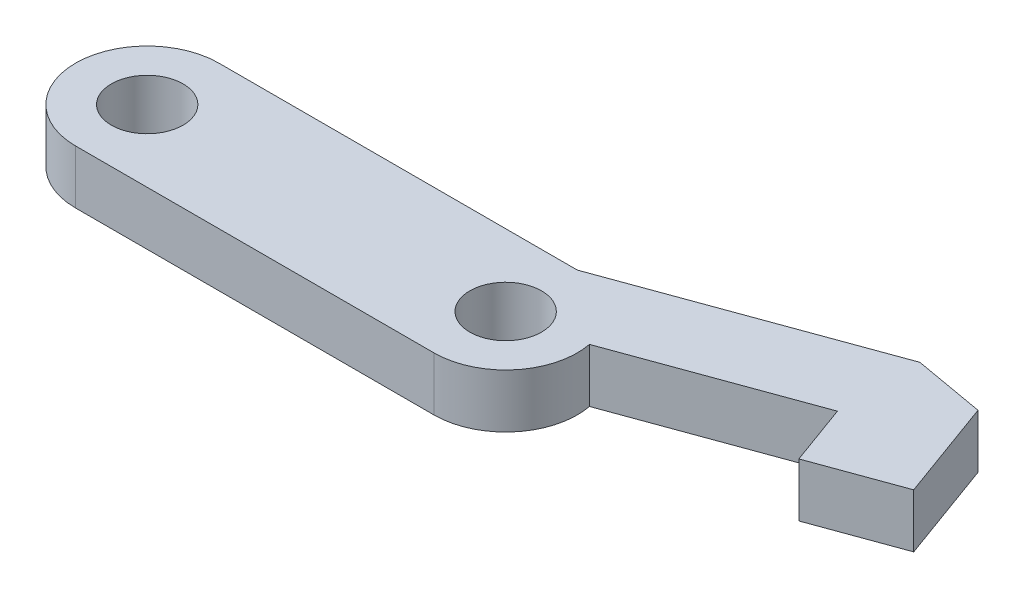
ISO-10303-21;
HEADER;
FILE_DESCRIPTION(('STEP AP214'),'2;1');
FILE_NAME('part.step','',(''),(''),'','','');
FILE_SCHEMA(('AUTOMOTIVE_DESIGN { 1 0 10303 214 1 1 1 1 }'));
ENDSEC;
DATA;
#1=APPLICATION_CONTEXT('core data for automotive mechanical design processes');
#2=APPLICATION_PROTOCOL_DEFINITION('international standard','automotive_design',2000,#1);
#3=PRODUCT_CONTEXT('',#1,'mechanical');
#4=PRODUCT('Part','Part','',(#3));
#5=PRODUCT_RELATED_PRODUCT_CATEGORY('part','',(#4));
#6=PRODUCT_DEFINITION_FORMATION('','',#4);
#7=PRODUCT_DEFINITION_CONTEXT('part definition',#1,'design');
#8=PRODUCT_DEFINITION('design','',#6,#7);
#9=PRODUCT_DEFINITION_SHAPE('','',#8);
#10=(LENGTH_UNIT() NAMED_UNIT(*) SI_UNIT(.MILLI.,.METRE.));
#11=(NAMED_UNIT(*) PLANE_ANGLE_UNIT() SI_UNIT($,.RADIAN.));
#12=(NAMED_UNIT(*) SI_UNIT($,.STERADIAN.) SOLID_ANGLE_UNIT());
#13=UNCERTAINTY_MEASURE_WITH_UNIT(LENGTH_MEASURE(1.E-05),#10,'distance_accuracy_value','');
#14=(GEOMETRIC_REPRESENTATION_CONTEXT(3) GLOBAL_UNCERTAINTY_ASSIGNED_CONTEXT((#13)) GLOBAL_UNIT_ASSIGNED_CONTEXT((#10,
#11,#12)) REPRESENTATION_CONTEXT('',''));
#15=CARTESIAN_POINT('',(0.,0.,0.));
#16=DIRECTION('',(0.,0.,1.));
#17=DIRECTION('',(1.,0.,0.));
#18=AXIS2_PLACEMENT_3D('',#15,#16,#17);
#19=CARTESIAN_POINT('',(-11.0849255853413,9.75,-11.4853963661273));
#20=DIRECTION('',(0.,0.,1.));
#21=DIRECTION('',(1.,0.,0.));
#22=AXIS2_PLACEMENT_3D('',#19,#20,#21);
#23=PLANE('',#22);
#24=DIRECTION('',(-1.,0.,0.));
#25=VECTOR('',#24,1.);
#26=CARTESIAN_POINT('',(-11.0849255853413,5.25,-11.4853963661273));
#27=LINE('',#26,#25);
#28=CARTESIAN_POINT('',(-11.0849255853413,5.25,-11.4853963661273));
#29=VERTEX_POINT('',#28);
#30=CARTESIAN_POINT('',(-41.0849255853412,5.25,-11.4853963661273));
#31=VERTEX_POINT('',#30);
#32=EDGE_CURVE('E145',#29,#31,#27,.T.);
#33=ORIENTED_EDGE('',*,*,#32,.T.);
#34=DIRECTION('',(0.,-1.,0.));
#35=VECTOR('',#34,1.);
#36=CARTESIAN_POINT('',(-41.0849255853412,9.75,-11.4853963661273));
#37=LINE('',#36,#35);
#38=CARTESIAN_POINT('',(-41.0849255853412,9.75,-11.4853963661273));
#39=VERTEX_POINT('',#38);
#40=EDGE_CURVE('E11',#39,#31,#37,.T.);
#41=ORIENTED_EDGE('',*,*,#40,.F.);
#42=DIRECTION('',(-1.,0.,0.));
#43=VECTOR('',#42,1.);
#44=CARTESIAN_POINT('',(-11.0849255853413,9.75,-11.4853963661273));
#45=LINE('',#44,#43);
#46=CARTESIAN_POINT('',(-11.0849255853413,9.75,-11.4853963661273));
#47=VERTEX_POINT('',#46);
#48=EDGE_CURVE('E172',#47,#39,#45,.T.);
#49=ORIENTED_EDGE('',*,*,#48,.F.);
#50=DIRECTION('',(0.,-1.,0.));
#51=VECTOR('',#50,1.);
#52=CARTESIAN_POINT('',(-11.0849255853413,9.75,-11.4853963661273));
#53=LINE('',#52,#51);
#54=EDGE_CURVE('E52',#47,#29,#53,.T.);
#55=ORIENTED_EDGE('',*,*,#54,.T.);
#56=EDGE_LOOP('',(#33,#41,#49,#55));
#57=FACE_BOUND('',#56,.T.);
#58=ADVANCED_FACE('F36',(#57),#23,.F.);
#59=CARTESIAN_POINT('',(-41.0849255853412,9.75,-5.48539636612727));
#60=DIRECTION('',(0.,-1.,0.));
#61=DIRECTION('',(0.,0.,-1.));
#62=AXIS2_PLACEMENT_3D('',#59,#60,#61);
#63=CYLINDRICAL_SURFACE('',#62,6.);
#64=CARTESIAN_POINT('',(-41.0849255853412,5.25,-5.48539636612727));
#65=DIRECTION('',(0.,1.,0.));
#66=DIRECTION('',(0.,0.,1.));
#67=AXIS2_PLACEMENT_3D('',#64,#65,#66);
#68=CIRCLE('',#67,6.);
#69=CARTESIAN_POINT('',(-41.0849255853412,5.25,0.514603633872726));
#70=VERTEX_POINT('',#69);
#71=EDGE_CURVE('E147',#31,#70,#68,.T.);
#72=ORIENTED_EDGE('',*,*,#71,.T.);
#73=DIRECTION('',(0.,-1.,0.));
#74=VECTOR('',#73,1.);
#75=CARTESIAN_POINT('',(-41.0849255853412,9.75,0.514603633872726));
#76=LINE('',#75,#74);
#77=CARTESIAN_POINT('',(-41.0849255853412,9.75,0.514603633872726));
#78=VERTEX_POINT('',#77);
#79=EDGE_CURVE('E44',#78,#70,#76,.T.);
#80=ORIENTED_EDGE('',*,*,#79,.F.);
#81=CARTESIAN_POINT('',(-41.0849255853412,9.75,-5.48539636612727));
#82=DIRECTION('',(0.,1.,0.));
#83=DIRECTION('',(0.,0.,1.));
#84=AXIS2_PLACEMENT_3D('',#81,#82,#83);
#85=CIRCLE('',#84,6.);
#86=EDGE_CURVE('E96',#39,#78,#85,.T.);
#87=ORIENTED_EDGE('',*,*,#86,.F.);
#88=ORIENTED_EDGE('',*,*,#40,.T.);
#89=EDGE_LOOP('',(#72,#80,#87,#88));
#90=FACE_BOUND('',#89,.T.);
#91=ADVANCED_FACE('F189',(#90),#63,.T.);
#92=CARTESIAN_POINT('',(-11.0849255853413,9.75,0.514603633872722));
#93=DIRECTION('',(0.,0.,1.));
#94=DIRECTION('',(1.,0.,0.));
#95=AXIS2_PLACEMENT_3D('',#92,#93,#94);
#96=PLANE('',#95);
#97=DIRECTION('',(-1.,0.,0.));
#98=VECTOR('',#97,1.);
#99=CARTESIAN_POINT('',(-11.0849255853413,5.25,0.514603633872722));
#100=LINE('',#99,#98);
#101=CARTESIAN_POINT('',(-11.0849255853413,5.25,0.514603633872722));
#102=VERTEX_POINT('',#101);
#103=EDGE_CURVE('E151',#102,#70,#100,.T.);
#104=ORIENTED_EDGE('',*,*,#103,.F.);
#105=DIRECTION('',(0.,-1.,0.));
#106=VECTOR('',#105,1.);
#107=CARTESIAN_POINT('',(-11.0849255853413,9.75,0.514603633872722));
#108=LINE('',#107,#106);
#109=CARTESIAN_POINT('',(-11.0849255853413,9.75,0.514603633872722));
#110=VERTEX_POINT('',#109);
#111=EDGE_CURVE('E182',#110,#102,#108,.T.);
#112=ORIENTED_EDGE('',*,*,#111,.F.);
#113=DIRECTION('',(-1.,0.,0.));
#114=VECTOR('',#113,1.);
#115=CARTESIAN_POINT('',(-11.0849255853413,9.75,0.514603633872722));
#116=LINE('',#115,#114);
#117=EDGE_CURVE('E188',#110,#78,#116,.T.);
#118=ORIENTED_EDGE('',*,*,#117,.T.);
#119=ORIENTED_EDGE('',*,*,#79,.T.);
#120=EDGE_LOOP('',(#104,#112,#118,#119));
#121=FACE_BOUND('',#120,.T.);
#122=ADVANCED_FACE('F186',(#121),#96,.T.);
#123=CARTESIAN_POINT('',(-11.0849255853413,9.75,-5.48539636612728));
#124=DIRECTION('',(0.,-1.,0.));
#125=DIRECTION('',(0.,0.,-1.));
#126=AXIS2_PLACEMENT_3D('',#123,#124,#125);
#127=CYLINDRICAL_SURFACE('',#126,6.);
#128=CARTESIAN_POINT('',(-11.0849255853413,5.25,-5.48539636612728));
#129=DIRECTION('',(0.,1.,0.));
#130=DIRECTION('',(0.,0.,1.));
#131=AXIS2_PLACEMENT_3D('',#128,#129,#130);
#132=CIRCLE('',#131,6.);
#133=CARTESIAN_POINT('',(-5.19071720724014,5.25,-6.60713947197755));
#134=VERTEX_POINT('',#133);
#135=EDGE_CURVE('E154',#102,#134,#132,.T.);
#136=ORIENTED_EDGE('',*,*,#135,.T.);
#137=DIRECTION('',(0.,-1.,0.));
#138=VECTOR('',#137,1.);
#139=CARTESIAN_POINT('',(-5.19071720724014,9.75,-6.60713947197755));
#140=LINE('',#139,#138);
#141=CARTESIAN_POINT('',(-5.19071720724014,9.75,-6.60713947197755));
#142=VERTEX_POINT('',#141);
#143=EDGE_CURVE('E180',#142,#134,#140,.T.);
#144=ORIENTED_EDGE('',*,*,#143,.F.);
#145=CARTESIAN_POINT('',(-11.0849255853413,9.75,-5.48539636612728));
#146=DIRECTION('',(0.,1.,0.));
#147=DIRECTION('',(0.,0.,1.));
#148=AXIS2_PLACEMENT_3D('',#145,#146,#147);
#149=CIRCLE('',#148,6.);
#150=EDGE_CURVE('E200',#110,#142,#149,.T.);
#151=ORIENTED_EDGE('',*,*,#150,.F.);
#152=ORIENTED_EDGE('',*,*,#111,.T.);
#153=EDGE_LOOP('',(#136,#144,#151,#152));
#154=FACE_BOUND('',#153,.T.);
#155=ADVANCED_FACE('F197',(#154),#127,.T.);
#156=CARTESIAN_POINT('',(-10.7559554684514,9.75,-4.5815583982972));
#157=DIRECTION('',(0.342020143325674,0.,0.939692620785907));
#158=DIRECTION('',(0.939692620785907,0.,-0.342020143325674));
#159=AXIS2_PLACEMENT_3D('',#156,#157,#158);
#160=PLANE('',#159);
#161=DIRECTION('',(-0.939692620785907,0.,0.342020143325674));
#162=VECTOR('',#161,1.);
#163=CARTESIAN_POINT('',(-10.7559554684514,5.25,-4.5815583982972));
#164=LINE('',#163,#162);
#165=CARTESIAN_POINT('',(10.0204709848059,5.25,-12.1435592017039));
#166=VERTEX_POINT('',#165);
#167=EDGE_CURVE('E157',#166,#134,#164,.T.);
#168=ORIENTED_EDGE('',*,*,#167,.F.);
#169=DIRECTION('',(0.,-1.,0.));
#170=VECTOR('',#169,1.);
#171=CARTESIAN_POINT('',(10.0204709848059,9.75,-12.1435592017039));
#172=LINE('',#171,#170);
#173=CARTESIAN_POINT('',(10.0204709848059,9.75,-12.1435592017039));
#174=VERTEX_POINT('',#173);
#175=EDGE_CURVE('E178',#174,#166,#172,.T.);
#176=ORIENTED_EDGE('',*,*,#175,.F.);
#177=DIRECTION('',(-0.939692620785907,0.,0.342020143325674));
#178=VECTOR('',#177,1.);
#179=CARTESIAN_POINT('',(-10.7559554684514,9.75,-4.5815583982972));
#180=LINE('',#179,#178);
#181=EDGE_CURVE('E202',#174,#142,#180,.T.);
#182=ORIENTED_EDGE('',*,*,#181,.T.);
#183=ORIENTED_EDGE('',*,*,#143,.T.);
#184=EDGE_LOOP('',(#168,#176,#182,#183));
#185=FACE_BOUND('',#184,.T.);
#186=ADVANCED_FACE('F305',(#185),#160,.T.);
#187=CARTESIAN_POINT('',(9.69150086791618,9.75,-13.0473971695337));
#188=DIRECTION('',(-0.939692620785912,0.,0.34202014332566));
#189=DIRECTION('',(0.34202014332566,0.,0.939692620785912));
#190=AXIS2_PLACEMENT_3D('',#187,#188,#189);
#191=PLANE('',#190);
#192=DIRECTION('',(-0.34202014332566,0.,-0.939692620785912));
#193=VECTOR('',#192,1.);
#194=CARTESIAN_POINT('',(9.69150086791618,5.25,-13.0473971695337));
#195=LINE('',#194,#193);
#196=CARTESIAN_POINT('',(11.8673797587644,5.25,-7.06921904945999));
#197=VERTEX_POINT('',#196);
#198=EDGE_CURVE('E160',#197,#166,#195,.T.);
#199=ORIENTED_EDGE('',*,*,#198,.F.);
#200=DIRECTION('',(0.,-1.,0.));
#201=VECTOR('',#200,1.);
#202=CARTESIAN_POINT('',(11.8673797587644,9.75,-7.06921904945999));
#203=LINE('',#202,#201);
#204=CARTESIAN_POINT('',(11.8673797587644,9.75,-7.06921904945999));
#205=VERTEX_POINT('',#204);
#206=EDGE_CURVE('E176',#205,#197,#203,.T.);
#207=ORIENTED_EDGE('',*,*,#206,.F.);
#208=DIRECTION('',(-0.34202014332566,0.,-0.939692620785912));
#209=VECTOR('',#208,1.);
#210=CARTESIAN_POINT('',(9.69150086791618,9.75,-13.0473971695337));
#211=LINE('',#210,#209);
#212=EDGE_CURVE('E209',#205,#174,#211,.T.);
#213=ORIENTED_EDGE('',*,*,#212,.T.);
#214=ORIENTED_EDGE('',*,*,#175,.T.);
#215=EDGE_LOOP('',(#199,#207,#213,#214));
#216=FACE_BOUND('',#215,.T.);
#217=ADVANCED_FACE('F296',(#216),#191,.T.);
#218=CARTESIAN_POINT('',(-8.90904669449294,9.75,0.492781753946513));
#219=DIRECTION('',(0.342020143325665,0.,0.93969262078591));
#220=DIRECTION('',(0.93969262078591,0.,-0.342020143325665));
#221=AXIS2_PLACEMENT_3D('',#218,#219,#220);
#222=PLANE('',#221);
#223=DIRECTION('',(-0.93969262078591,0.,0.342020143325665));
#224=VECTOR('',#223,1.);
#225=CARTESIAN_POINT('',(-8.90904669449294,5.25,0.492781753946513));
#226=LINE('',#225,#224);
#227=CARTESIAN_POINT('',(18.9150744146587,5.25,-9.63437012440248));
#228=VERTEX_POINT('',#227);
#229=EDGE_CURVE('E163',#228,#197,#226,.T.);
#230=ORIENTED_EDGE('',*,*,#229,.F.);
#231=DIRECTION('',(0.,-1.,0.));
#232=VECTOR('',#231,1.);
#233=CARTESIAN_POINT('',(18.9150744146587,9.75,-9.63437012440248));
#234=LINE('',#233,#232);
#235=CARTESIAN_POINT('',(18.9150744146587,9.75,-9.63437012440248));
#236=VERTEX_POINT('',#235);
#237=EDGE_CURVE('E127',#236,#228,#234,.T.);
#238=ORIENTED_EDGE('',*,*,#237,.F.);
#239=DIRECTION('',(-0.93969262078591,0.,0.342020143325665));
#240=VECTOR('',#239,1.);
#241=CARTESIAN_POINT('',(-8.90904669449294,9.75,0.492781753946513));
#242=LINE('',#241,#240);
#243=EDGE_CURVE('E137',#236,#205,#242,.T.);
#244=ORIENTED_EDGE('',*,*,#243,.T.);
#245=ORIENTED_EDGE('',*,*,#206,.T.);
#246=EDGE_LOOP('',(#230,#238,#244,#245));
#247=FACE_BOUND('',#246,.T.);
#248=ADVANCED_FACE('F213',(#247),#222,.T.);
#249=CARTESIAN_POINT('',(16.7391955238103,9.75,-15.6125482444765));
#250=DIRECTION('',(0.939692620785907,0.,-0.342020143325674));
#251=DIRECTION('',(-0.342020143325674,0.,-0.939692620785907));
#252=AXIS2_PLACEMENT_3D('',#249,#250,#251);
#253=PLANE('',#252);
#254=DIRECTION('',(0.342020143325673,0.,0.939692620785907));
#255=VECTOR('',#254,1.);
#256=CARTESIAN_POINT('',(16.7391955238103,5.25,-15.6125482444765));
#257=LINE('',#256,#255);
#258=CARTESIAN_POINT('',(15.8368931247277,5.25,-18.0916037114757));
#259=VERTEX_POINT('',#258);
#260=EDGE_CURVE('E123',#259,#228,#257,.T.);
#261=ORIENTED_EDGE('',*,*,#260,.F.);
#262=DIRECTION('',(0.,-1.,0.));
#263=VECTOR('',#262,1.);
#264=CARTESIAN_POINT('',(15.8368931247277,9.75,-18.0916037114757));
#265=LINE('',#264,#263);
#266=CARTESIAN_POINT('',(15.8368931247277,9.75,-18.0916037114757));
#267=VERTEX_POINT('',#266);
#268=EDGE_CURVE('E118',#267,#259,#265,.T.);
#269=ORIENTED_EDGE('',*,*,#268,.F.);
#270=DIRECTION('',(0.342020143325673,0.,0.939692620785907));
#271=VECTOR('',#270,1.);
#272=CARTESIAN_POINT('',(16.7391955238103,9.75,-15.6125482444765));
#273=LINE('',#272,#271);
#274=EDGE_CURVE('E121',#267,#236,#273,.T.);
#275=ORIENTED_EDGE('',*,*,#274,.T.);
#276=ORIENTED_EDGE('',*,*,#237,.T.);
#277=EDGE_LOOP('',(#261,#269,#275,#276));
#278=FACE_BOUND('',#277,.T.);
#279=ADVANCED_FACE('F120',(#278),#253,.T.);
#280=CARTESIAN_POINT('',(-8.11734499877626,9.75,-22.3153821949646));
#281=DIRECTION('',(0.173648177666923,0.,-0.984807753012209));
#282=DIRECTION('',(-0.984807753012209,0.,-0.173648177666923));
#283=AXIS2_PLACEMENT_3D('',#280,#281,#282);
#284=PLANE('',#283);
#285=DIRECTION('',(0.98480775301221,0.,0.173648177666923));
#286=VECTOR('',#285,1.);
#287=CARTESIAN_POINT('',(-8.11734499877626,5.25,-22.3153821949646));
#288=LINE('',#287,#286);
#289=CARTESIAN_POINT('',(9.9280466066544,5.25,-19.1334927774773));
#290=VERTEX_POINT('',#289);
#291=EDGE_CURVE('E167',#290,#259,#288,.T.);
#292=ORIENTED_EDGE('',*,*,#291,.F.);
#293=DIRECTION('',(0.,-1.,0.));
#294=VECTOR('',#293,1.);
#295=CARTESIAN_POINT('',(9.9280466066544,9.75,-19.1334927774773));
#296=LINE('',#295,#294);
#297=CARTESIAN_POINT('',(9.9280466066544,9.75,-19.1334927774773));
#298=VERTEX_POINT('',#297);
#299=EDGE_CURVE('E84',#298,#290,#296,.T.);
#300=ORIENTED_EDGE('',*,*,#299,.F.);
#301=DIRECTION('',(0.98480775301221,0.,0.173648177666923));
#302=VECTOR('',#301,1.);
#303=CARTESIAN_POINT('',(-8.11734499877626,9.75,-22.3153821949646));
#304=LINE('',#303,#302);
#305=EDGE_CURVE('E134',#298,#267,#304,.T.);
#306=ORIENTED_EDGE('',*,*,#305,.T.);
#307=ORIENTED_EDGE('',*,*,#268,.T.);
#308=EDGE_LOOP('',(#292,#300,#306,#307));
#309=FACE_BOUND('',#308,.T.);
#310=ADVANCED_FACE('F139',(#309),#284,.T.);
#311=CARTESIAN_POINT('',(-13.0132884144009,9.75,-10.7835296954842));
#312=DIRECTION('',(-0.342020143325673,0.,-0.939692620785907));
#313=DIRECTION('',(-0.939692620785907,0.,0.342020143325673));
#314=AXIS2_PLACEMENT_3D('',#311,#312,#313);
#315=PLANE('',#314);
#316=DIRECTION('',(0.939692620785907,0.,-0.342020143325673));
#317=VECTOR('',#316,1.);
#318=CARTESIAN_POINT('',(-13.0132884144009,5.25,-10.7835296954842));
#319=LINE('',#318,#317);
#320=EDGE_CURVE('E169',#29,#290,#319,.T.);
#321=ORIENTED_EDGE('',*,*,#320,.F.);
#322=ORIENTED_EDGE('',*,*,#54,.F.);
#323=DIRECTION('',(0.939692620785907,0.,-0.342020143325673));
#324=VECTOR('',#323,1.);
#325=CARTESIAN_POINT('',(-13.0132884144009,9.75,-10.7835296954842));
#326=LINE('',#325,#324);
#327=EDGE_CURVE('E140',#47,#298,#326,.T.);
#328=ORIENTED_EDGE('',*,*,#327,.T.);
#329=ORIENTED_EDGE('',*,*,#299,.T.);
#330=EDGE_LOOP('',(#321,#322,#328,#329));
#331=FACE_BOUND('',#330,.T.);
#332=ADVANCED_FACE('F215',(#331),#315,.T.);
#333=CARTESIAN_POINT('',(-11.0849255853413,9.75,-5.48539636612728));
#334=DIRECTION('',(0.,1.,0.));
#335=DIRECTION('',(0.,0.,1.));
#336=AXIS2_PLACEMENT_3D('',#333,#334,#335);
#337=PLANE('',#336);
#338=CARTESIAN_POINT('',(-41.0849255853412,9.75,-5.48539636612727));
#339=DIRECTION('',(0.,1.,0.));
#340=DIRECTION('',(0.,0.,1.));
#341=AXIS2_PLACEMENT_3D('',#338,#339,#340);
#342=CIRCLE('',#341,3.);
#343=CARTESIAN_POINT('',(-41.0849255853412,9.75,-2.48539636612728));
#344=VERTEX_POINT('',#343);
#345=EDGE_CURVE('E239',#344,#344,#342,.T.);
#346=ORIENTED_EDGE('',*,*,#345,.F.);
#347=EDGE_LOOP('',(#346));
#348=FACE_BOUND('',#347,.T.);
#349=CARTESIAN_POINT('',(-11.0849255853413,9.75,-5.48539636612728));
#350=DIRECTION('',(0.,1.,0.));
#351=DIRECTION('',(0.,0.,1.));
#352=AXIS2_PLACEMENT_3D('',#349,#350,#351);
#353=CIRCLE('',#352,3.);
#354=CARTESIAN_POINT('',(-11.0849255853413,9.75,-2.48539636612728));
#355=VERTEX_POINT('',#354);
#356=EDGE_CURVE('E233',#355,#355,#353,.T.);
#357=ORIENTED_EDGE('',*,*,#356,.F.);
#358=EDGE_LOOP('',(#357));
#359=FACE_BOUND('',#358,.T.);
#360=ORIENTED_EDGE('',*,*,#48,.T.);
#361=ORIENTED_EDGE('',*,*,#86,.T.);
#362=ORIENTED_EDGE('',*,*,#117,.F.);
#363=ORIENTED_EDGE('',*,*,#150,.T.);
#364=ORIENTED_EDGE('',*,*,#181,.F.);
#365=ORIENTED_EDGE('',*,*,#212,.F.);
#366=ORIENTED_EDGE('',*,*,#243,.F.);
#367=ORIENTED_EDGE('',*,*,#274,.F.);
#368=ORIENTED_EDGE('',*,*,#305,.F.);
#369=ORIENTED_EDGE('',*,*,#327,.F.);
#370=EDGE_LOOP('',(#360,#361,#362,#363,#364,#365,#366,#367,#368,#369));
#371=FACE_BOUND('',#370,.T.);
#372=ADVANCED_FACE('F132',(#348,#359,#371),#337,.T.);
#373=CARTESIAN_POINT('',(-11.0849255853413,5.25,-5.48539636612728));
#374=DIRECTION('',(0.,1.,0.));
#375=DIRECTION('',(0.,0.,1.));
#376=AXIS2_PLACEMENT_3D('',#373,#374,#375);
#377=PLANE('',#376);
#378=CARTESIAN_POINT('',(-41.0849255853412,5.25,-5.48539636612727));
#379=DIRECTION('',(0.,1.,0.));
#380=DIRECTION('',(0.,0.,1.));
#381=AXIS2_PLACEMENT_3D('',#378,#379,#380);
#382=CIRCLE('',#381,3.);
#383=CARTESIAN_POINT('',(-41.0849255853412,5.25,-2.48539636612728));
#384=VERTEX_POINT('',#383);
#385=EDGE_CURVE('E236',#384,#384,#382,.T.);
#386=ORIENTED_EDGE('',*,*,#385,.T.);
#387=EDGE_LOOP('',(#386));
#388=FACE_BOUND('',#387,.T.);
#389=CARTESIAN_POINT('',(-11.0849255853413,5.25,-5.48539636612728));
#390=DIRECTION('',(0.,1.,0.));
#391=DIRECTION('',(0.,0.,1.));
#392=AXIS2_PLACEMENT_3D('',#389,#390,#391);
#393=CIRCLE('',#392,3.);
#394=CARTESIAN_POINT('',(-11.0849255853413,5.25,-2.48539636612728));
#395=VERTEX_POINT('',#394);
#396=EDGE_CURVE('E148',#395,#395,#393,.T.);
#397=ORIENTED_EDGE('',*,*,#396,.T.);
#398=EDGE_LOOP('',(#397));
#399=FACE_BOUND('',#398,.T.);
#400=ORIENTED_EDGE('',*,*,#32,.F.);
#401=ORIENTED_EDGE('',*,*,#320,.T.);
#402=ORIENTED_EDGE('',*,*,#291,.T.);
#403=ORIENTED_EDGE('',*,*,#260,.T.);
#404=ORIENTED_EDGE('',*,*,#229,.T.);
#405=ORIENTED_EDGE('',*,*,#198,.T.);
#406=ORIENTED_EDGE('',*,*,#167,.T.);
#407=ORIENTED_EDGE('',*,*,#135,.F.);
#408=ORIENTED_EDGE('',*,*,#103,.T.);
#409=ORIENTED_EDGE('',*,*,#71,.F.);
#410=EDGE_LOOP('',(#400,#401,#402,#403,#404,#405,#406,#407,#408,#409));
#411=FACE_BOUND('',#410,.T.);
#412=ADVANCED_FACE('F193',(#388,#399,#411),#377,.F.);
#413=CARTESIAN_POINT('',(-11.0849255853413,9.75,-5.48539636612728));
#414=DIRECTION('',(0.,1.,0.));
#415=DIRECTION('',(0.,0.,1.));
#416=AXIS2_PLACEMENT_3D('',#413,#414,#415);
#417=CYLINDRICAL_SURFACE('',#416,3.);
#418=ORIENTED_EDGE('',*,*,#396,.F.);
#419=EDGE_LOOP('',(#418));
#420=FACE_BOUND('',#419,.T.);
#421=ORIENTED_EDGE('',*,*,#356,.T.);
#422=EDGE_LOOP('',(#421));
#423=FACE_BOUND('',#422,.T.);
#424=ADVANCED_FACE('F247',(#420,#423),#417,.F.);
#425=CARTESIAN_POINT('',(-41.0849255853412,9.75,-5.48539636612727));
#426=DIRECTION('',(0.,1.,0.));
#427=DIRECTION('',(0.,0.,1.));
#428=AXIS2_PLACEMENT_3D('',#425,#426,#427);
#429=CYLINDRICAL_SURFACE('',#428,3.);
#430=ORIENTED_EDGE('',*,*,#385,.F.);
#431=EDGE_LOOP('',(#430));
#432=FACE_BOUND('',#431,.T.);
#433=ORIENTED_EDGE('',*,*,#345,.T.);
#434=EDGE_LOOP('',(#433));
#435=FACE_BOUND('',#434,.T.);
#436=ADVANCED_FACE('F243',(#432,#435),#429,.F.);
#437=CLOSED_SHELL('',(#58,#91,#122,#155,#186,#217,#248,#279,#310,#332,#372,#412,#424,#436));
#438=MANIFOLD_SOLID_BREP('B2',#437);
#439=ADVANCED_BREP_SHAPE_REPRESENTATION('',(#18,#438),#14);
#440=SHAPE_DEFINITION_REPRESENTATION(#9,#439);
ENDSEC;
END-ISO-10303-21;
